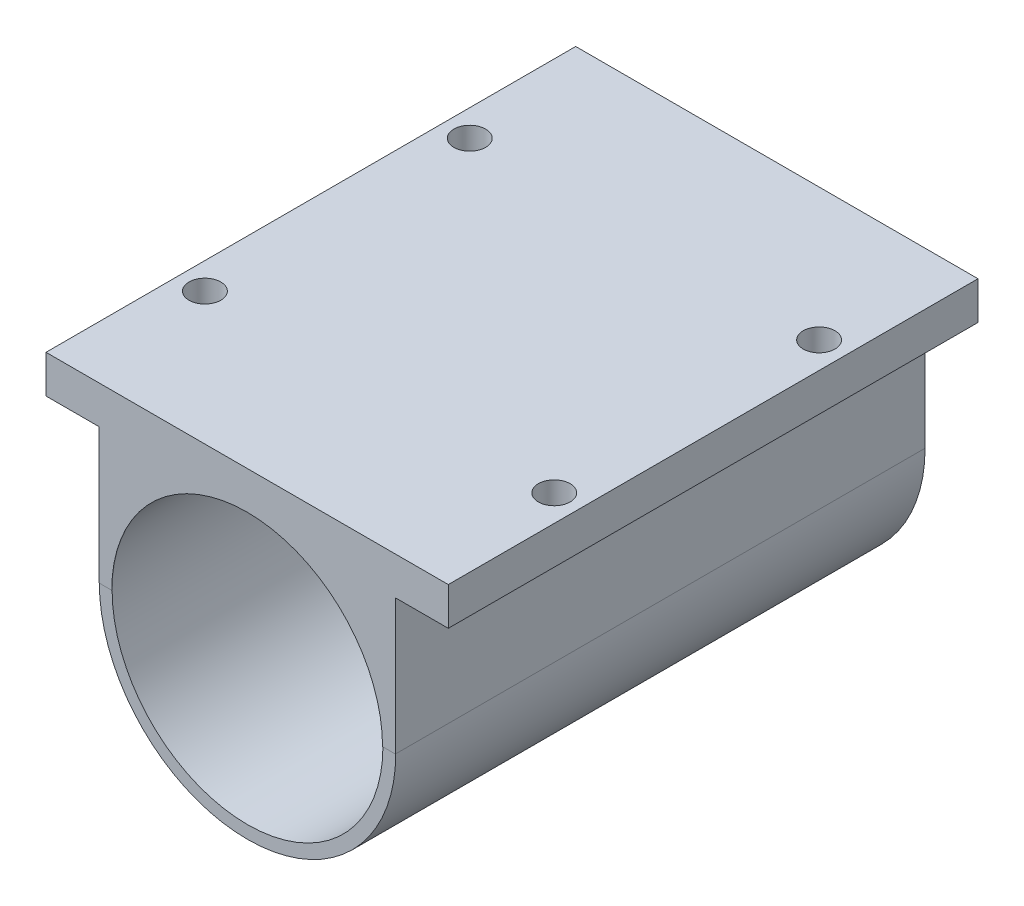
ISO-10303-21;
HEADER;
FILE_DESCRIPTION(('STEP AP214'),'2;1');
FILE_NAME('part.step','',(''),(''),'','','');
FILE_SCHEMA(('AUTOMOTIVE_DESIGN { 1 0 10303 214 1 1 1 1 }'));
ENDSEC;
DATA;
#1=APPLICATION_CONTEXT('core data for automotive mechanical design processes');
#2=APPLICATION_PROTOCOL_DEFINITION('international standard','automotive_design',2000,#1);
#3=PRODUCT_CONTEXT('',#1,'mechanical');
#4=PRODUCT('Part','Part','',(#3));
#5=PRODUCT_RELATED_PRODUCT_CATEGORY('part','',(#4));
#6=PRODUCT_DEFINITION_FORMATION('','',#4);
#7=PRODUCT_DEFINITION_CONTEXT('part definition',#1,'design');
#8=PRODUCT_DEFINITION('design','',#6,#7);
#9=PRODUCT_DEFINITION_SHAPE('','',#8);
#10=(LENGTH_UNIT() NAMED_UNIT(*) SI_UNIT(.MILLI.,.METRE.));
#11=(NAMED_UNIT(*) PLANE_ANGLE_UNIT() SI_UNIT($,.RADIAN.));
#12=(NAMED_UNIT(*) SI_UNIT($,.STERADIAN.) SOLID_ANGLE_UNIT());
#13=UNCERTAINTY_MEASURE_WITH_UNIT(LENGTH_MEASURE(1.E-05),#10,'distance_accuracy_value','');
#14=(GEOMETRIC_REPRESENTATION_CONTEXT(3) GLOBAL_UNCERTAINTY_ASSIGNED_CONTEXT((#13)) GLOBAL_UNIT_ASSIGNED_CONTEXT((#10,
#11,#12)) REPRESENTATION_CONTEXT('',''));
#15=CARTESIAN_POINT('',(0.,0.,0.));
#16=DIRECTION('',(0.,0.,1.));
#17=DIRECTION('',(1.,0.,0.));
#18=AXIS2_PLACEMENT_3D('',#15,#16,#17);
#19=CARTESIAN_POINT('',(-14.,21.,0.));
#20=DIRECTION('',(1.,0.,0.));
#21=DIRECTION('',(0.,0.,-1.));
#22=AXIS2_PLACEMENT_3D('',#19,#20,#21);
#23=PLANE('',#22);
#24=DIRECTION('',(0.,0.,1.));
#25=VECTOR('',#24,1.);
#26=CARTESIAN_POINT('',(-14.,12.7853008732396,0.));
#27=LINE('',#26,#25);
#28=CARTESIAN_POINT('',(-14.,12.7853008732396,0.));
#29=VERTEX_POINT('',#28);
#30=CARTESIAN_POINT('',(-14.,12.7853008732396,50.0348809107223));
#31=VERTEX_POINT('',#30);
#32=EDGE_CURVE('E143',#29,#31,#27,.T.);
#33=ORIENTED_EDGE('',*,*,#32,.F.);
#34=DIRECTION('',(0.,-1.,0.));
#35=VECTOR('',#34,1.);
#36=CARTESIAN_POINT('',(-14.,21.,0.));
#37=LINE('',#36,#35);
#38=CARTESIAN_POINT('',(-14.,0.,0.));
#39=VERTEX_POINT('',#38);
#40=EDGE_CURVE('E148',#29,#39,#37,.T.);
#41=ORIENTED_EDGE('',*,*,#40,.T.);
#42=DIRECTION('',(0.,0.,1.));
#43=VECTOR('',#42,1.);
#44=CARTESIAN_POINT('',(-14.,0.,0.));
#45=LINE('',#44,#43);
#46=CARTESIAN_POINT('',(-14.,0.,50.));
#47=VERTEX_POINT('',#46);
#48=EDGE_CURVE('E209',#39,#47,#45,.T.);
#49=ORIENTED_EDGE('',*,*,#48,.T.);
#50=CARTESIAN_POINT('',(-14.,0.,50.0348809107223));
#51=VERTEX_POINT('',#50);
#52=EDGE_CURVE('E204',#47,#51,#45,.T.);
#53=ORIENTED_EDGE('',*,*,#52,.T.);
#54=DIRECTION('',(0.,-1.,0.));
#55=VECTOR('',#54,1.);
#56=CARTESIAN_POINT('',(-14.,21.,50.0348809107223));
#57=LINE('',#56,#55);
#58=EDGE_CURVE('E224',#31,#51,#57,.T.);
#59=ORIENTED_EDGE('',*,*,#58,.F.);
#60=EDGE_LOOP('',(#33,#41,#49,#53,#59));
#61=FACE_BOUND('',#60,.T.);
#62=ADVANCED_FACE('F37',(#61),#23,.F.);
#63=CARTESIAN_POINT('',(14.,21.,0.));
#64=DIRECTION('',(-1.,0.,0.));
#65=DIRECTION('',(0.,0.,1.));
#66=AXIS2_PLACEMENT_3D('',#63,#64,#65);
#67=PLANE('',#66);
#68=DIRECTION('',(0.,0.,-1.));
#69=VECTOR('',#68,1.);
#70=CARTESIAN_POINT('',(14.,12.7853008732396,50.0348809107223));
#71=LINE('',#70,#69);
#72=CARTESIAN_POINT('',(14.,12.7853008732396,50.0348809107223));
#73=VERTEX_POINT('',#72);
#74=CARTESIAN_POINT('',(14.,12.7853008732396,0.));
#75=VERTEX_POINT('',#74);
#76=EDGE_CURVE('E52',#73,#75,#71,.T.);
#77=ORIENTED_EDGE('',*,*,#76,.F.);
#78=DIRECTION('',(0.,-1.,0.));
#79=VECTOR('',#78,1.);
#80=CARTESIAN_POINT('',(14.,21.,50.0348809107223));
#81=LINE('',#80,#79);
#82=CARTESIAN_POINT('',(14.,0.,50.0348809107223));
#83=VERTEX_POINT('',#82);
#84=EDGE_CURVE('E222',#73,#83,#81,.T.);
#85=ORIENTED_EDGE('',*,*,#84,.T.);
#86=DIRECTION('',(0.,0.,-1.));
#87=VECTOR('',#86,1.);
#88=CARTESIAN_POINT('',(14.,0.,0.));
#89=LINE('',#88,#87);
#90=CARTESIAN_POINT('',(14.,0.,50.));
#91=VERTEX_POINT('',#90);
#92=EDGE_CURVE('E217',#83,#91,#89,.T.);
#93=ORIENTED_EDGE('',*,*,#92,.T.);
#94=CARTESIAN_POINT('',(14.,0.,0.));
#95=VERTEX_POINT('',#94);
#96=EDGE_CURVE('E216',#91,#95,#89,.T.);
#97=ORIENTED_EDGE('',*,*,#96,.T.);
#98=DIRECTION('',(0.,-1.,0.));
#99=VECTOR('',#98,1.);
#100=CARTESIAN_POINT('',(14.,21.,0.));
#101=LINE('',#100,#99);
#102=EDGE_CURVE('E57',#75,#95,#101,.T.);
#103=ORIENTED_EDGE('',*,*,#102,.F.);
#104=EDGE_LOOP('',(#77,#85,#93,#97,#103));
#105=FACE_BOUND('',#104,.T.);
#106=ADVANCED_FACE('F290',(#105),#67,.F.);
#107=CARTESIAN_POINT('',(0.,0.,0.));
#108=DIRECTION('',(0.,1.,0.));
#109=DIRECTION('',(0.,0.,1.));
#110=AXIS2_PLACEMENT_3D('',#107,#108,#109);
#111=PLANE('',#110);
#112=DIRECTION('',(-1.,0.,0.));
#113=VECTOR('',#112,1.);
#114=CARTESIAN_POINT('',(0.,0.,50.));
#115=LINE('',#114,#113);
#116=CARTESIAN_POINT('',(-12.79,0.,50.));
#117=VERTEX_POINT('',#116);
#118=CARTESIAN_POINT('',(-12.7918119668143,0.,50.));
#119=VERTEX_POINT('',#118);
#120=EDGE_CURVE('E232',#117,#119,#115,.T.);
#121=ORIENTED_EDGE('',*,*,#120,.F.);
#122=DIRECTION('',(0.,0.,1.));
#123=VECTOR('',#122,1.);
#124=CARTESIAN_POINT('',(-12.79,0.,29.0348809107223));
#125=LINE('',#124,#123);
#126=CARTESIAN_POINT('',(-12.79,0.,50.0348809107223));
#127=VERTEX_POINT('',#126);
#128=EDGE_CURVE('E192',#117,#127,#125,.T.);
#129=ORIENTED_EDGE('',*,*,#128,.T.);
#130=DIRECTION('',(1.,0.,0.));
#131=VECTOR('',#130,1.);
#132=CARTESIAN_POINT('',(-14.,0.,50.0348809107223));
#133=LINE('',#132,#131);
#134=EDGE_CURVE('E213',#51,#127,#133,.T.);
#135=ORIENTED_EDGE('',*,*,#134,.F.);
#136=ORIENTED_EDGE('',*,*,#52,.F.);
#137=EDGE_CURVE('E226',#119,#47,#115,.T.);
#138=ORIENTED_EDGE('',*,*,#137,.F.);
#139=EDGE_LOOP('',(#121,#129,#135,#136,#138));
#140=FACE_BOUND('',#139,.T.);
#141=ADVANCED_FACE('F296',(#140),#111,.F.);
#142=CARTESIAN_POINT('',(0.,0.,50.));
#143=DIRECTION('',(0.,0.,-1.));
#144=DIRECTION('',(-1.,0.,0.));
#145=AXIS2_PLACEMENT_3D('',#142,#143,#144);
#146=CYLINDRICAL_SURFACE('',#145,14.);
#147=ORIENTED_EDGE('',*,*,#96,.F.);
#148=CARTESIAN_POINT('',(0.,0.,50.));
#149=DIRECTION('',(0.,0.,1.));
#150=DIRECTION('',(1.,0.,0.));
#151=AXIS2_PLACEMENT_3D('',#148,#149,#150);
#152=CIRCLE('',#151,14.);
#153=EDGE_CURVE('E233',#47,#91,#152,.T.);
#154=ORIENTED_EDGE('',*,*,#153,.F.);
#155=ORIENTED_EDGE('',*,*,#48,.F.);
#156=CARTESIAN_POINT('',(0.,0.,0.));
#157=DIRECTION('',(0.,0.,1.));
#158=DIRECTION('',(1.,0.,0.));
#159=AXIS2_PLACEMENT_3D('',#156,#157,#158);
#160=CIRCLE('',#159,14.);
#161=EDGE_CURVE('E230',#39,#95,#160,.T.);
#162=ORIENTED_EDGE('',*,*,#161,.T.);
#163=EDGE_LOOP('',(#147,#154,#155,#162));
#164=FACE_BOUND('',#163,.T.);
#165=ADVANCED_FACE('F304',(#164),#146,.T.);
#166=CARTESIAN_POINT('',(0.,0.,50.));
#167=DIRECTION('',(0.,0.,1.));
#168=DIRECTION('',(1.,0.,0.));
#169=AXIS2_PLACEMENT_3D('',#166,#167,#168);
#170=PLANE('',#169);
#171=CARTESIAN_POINT('',(0.,0.,50.));
#172=DIRECTION('',(0.,0.,1.));
#173=DIRECTION('',(1.,0.,0.));
#174=AXIS2_PLACEMENT_3D('',#171,#172,#173);
#175=CIRCLE('',#174,12.7918119668143);
#176=CARTESIAN_POINT('',(12.7918119668143,0.,50.));
#177=VERTEX_POINT('',#176);
#178=EDGE_CURVE('E208',#119,#177,#175,.T.);
#179=ORIENTED_EDGE('',*,*,#178,.F.);
#180=ORIENTED_EDGE('',*,*,#137,.T.);
#181=ORIENTED_EDGE('',*,*,#153,.T.);
#182=EDGE_CURVE('E227',#91,#177,#115,.T.);
#183=ORIENTED_EDGE('',*,*,#182,.T.);
#184=EDGE_LOOP('',(#179,#180,#181,#183));
#185=FACE_BOUND('',#184,.T.);
#186=ADVANCED_FACE('F301',(#185),#170,.T.);
#187=CARTESIAN_POINT('',(0.,0.,0.));
#188=DIRECTION('',(0.,0.,1.));
#189=DIRECTION('',(1.,0.,0.));
#190=AXIS2_PLACEMENT_3D('',#187,#188,#189);
#191=PLANE('',#190);
#192=CARTESIAN_POINT('',(0.,8.5,0.));
#193=DIRECTION('',(0.,0.,1.));
#194=DIRECTION('',(1.,0.,0.));
#195=AXIS2_PLACEMENT_3D('',#192,#193,#194);
#196=CIRCLE('',#195,2.5);
#197=CARTESIAN_POINT('',(2.5,8.5,0.));
#198=VERTEX_POINT('',#197);
#199=EDGE_CURVE('E268',#198,#198,#196,.T.);
#200=ORIENTED_EDGE('',*,*,#199,.T.);
#201=EDGE_LOOP('',(#200));
#202=FACE_BOUND('',#201,.T.);
#203=CARTESIAN_POINT('',(-8.5,0.,0.));
#204=DIRECTION('',(0.,0.,1.));
#205=DIRECTION('',(1.,0.,0.));
#206=AXIS2_PLACEMENT_3D('',#203,#204,#205);
#207=CIRCLE('',#206,2.5);
#208=CARTESIAN_POINT('',(-6.,0.,0.));
#209=VERTEX_POINT('',#208);
#210=EDGE_CURVE('E265',#209,#209,#207,.T.);
#211=ORIENTED_EDGE('',*,*,#210,.T.);
#212=EDGE_LOOP('',(#211));
#213=FACE_BOUND('',#212,.T.);
#214=CARTESIAN_POINT('',(0.,-8.5,0.));
#215=DIRECTION('',(0.,0.,1.));
#216=DIRECTION('',(1.,0.,0.));
#217=AXIS2_PLACEMENT_3D('',#214,#215,#216);
#218=CIRCLE('',#217,2.5);
#219=CARTESIAN_POINT('',(2.5,-8.5,0.));
#220=VERTEX_POINT('',#219);
#221=EDGE_CURVE('E262',#220,#220,#218,.T.);
#222=ORIENTED_EDGE('',*,*,#221,.T.);
#223=EDGE_LOOP('',(#222));
#224=FACE_BOUND('',#223,.T.);
#225=CARTESIAN_POINT('',(8.5,0.,0.));
#226=DIRECTION('',(0.,0.,1.));
#227=DIRECTION('',(1.,0.,0.));
#228=AXIS2_PLACEMENT_3D('',#225,#226,#227);
#229=CIRCLE('',#228,2.49999999999999);
#230=CARTESIAN_POINT('',(11.,0.,0.));
#231=VERTEX_POINT('',#230);
#232=EDGE_CURVE('E256',#231,#231,#229,.T.);
#233=ORIENTED_EDGE('',*,*,#232,.T.);
#234=EDGE_LOOP('',(#233));
#235=FACE_BOUND('',#234,.T.);
#236=CARTESIAN_POINT('',(0.,0.,0.));
#237=DIRECTION('',(0.,0.,-1.));
#238=DIRECTION('',(-1.,0.,0.));
#239=AXIS2_PLACEMENT_3D('',#236,#237,#238);
#240=CIRCLE('',#239,4.);
#241=CARTESIAN_POINT('',(-4.,0.,0.));
#242=VERTEX_POINT('',#241);
#243=EDGE_CURVE('E196',#242,#242,#240,.T.);
#244=ORIENTED_EDGE('',*,*,#243,.F.);
#245=EDGE_LOOP('',(#244));
#246=FACE_BOUND('',#245,.T.);
#247=ORIENTED_EDGE('',*,*,#40,.F.);
#248=DIRECTION('',(1.,0.,0.));
#249=VECTOR('',#248,1.);
#250=CARTESIAN_POINT('',(-19.,12.7853008732396,0.));
#251=LINE('',#250,#249);
#252=CARTESIAN_POINT('',(-19.,12.7853008732396,0.));
#253=VERTEX_POINT('',#252);
#254=EDGE_CURVE('E127',#253,#29,#251,.T.);
#255=ORIENTED_EDGE('',*,*,#254,.F.);
#256=DIRECTION('',(0.,-1.,0.));
#257=VECTOR('',#256,1.);
#258=CARTESIAN_POINT('',(-19.,16.3653008732396,0.));
#259=LINE('',#258,#257);
#260=CARTESIAN_POINT('',(-19.,16.3653008732396,0.));
#261=VERTEX_POINT('',#260);
#262=EDGE_CURVE('E135',#261,#253,#259,.T.);
#263=ORIENTED_EDGE('',*,*,#262,.F.);
#264=DIRECTION('',(1.,0.,0.));
#265=VECTOR('',#264,1.);
#266=CARTESIAN_POINT('',(0.,16.3653008732396,0.));
#267=LINE('',#266,#265);
#268=CARTESIAN_POINT('',(19.,16.3653008732396,0.));
#269=VERTEX_POINT('',#268);
#270=EDGE_CURVE('E185',#261,#269,#267,.T.);
#271=ORIENTED_EDGE('',*,*,#270,.T.);
#272=DIRECTION('',(0.,1.,0.));
#273=VECTOR('',#272,1.);
#274=CARTESIAN_POINT('',(19.,16.3653008732396,0.));
#275=LINE('',#274,#273);
#276=CARTESIAN_POINT('',(19.,12.7853008732396,0.));
#277=VERTEX_POINT('',#276);
#278=EDGE_CURVE('E170',#277,#269,#275,.T.);
#279=ORIENTED_EDGE('',*,*,#278,.F.);
#280=DIRECTION('',(-1.,0.,0.));
#281=VECTOR('',#280,1.);
#282=CARTESIAN_POINT('',(19.,12.7853008732396,0.));
#283=LINE('',#282,#281);
#284=EDGE_CURVE('E176',#277,#75,#283,.T.);
#285=ORIENTED_EDGE('',*,*,#284,.T.);
#286=ORIENTED_EDGE('',*,*,#102,.T.);
#287=ORIENTED_EDGE('',*,*,#161,.F.);
#288=EDGE_LOOP('',(#247,#255,#263,#271,#279,#285,#286,#287));
#289=FACE_BOUND('',#288,.T.);
#290=ADVANCED_FACE('F146',(#202,#213,#224,#235,#246,#289),#191,.F.);
#291=CARTESIAN_POINT('',(-14.,21.,50.0348809107223));
#292=DIRECTION('',(0.,0.,-1.));
#293=DIRECTION('',(-1.,0.,0.));
#294=AXIS2_PLACEMENT_3D('',#291,#292,#293);
#295=PLANE('',#294);
#296=ORIENTED_EDGE('',*,*,#84,.F.);
#297=DIRECTION('',(-1.,0.,0.));
#298=VECTOR('',#297,1.);
#299=CARTESIAN_POINT('',(19.,12.7853008732396,50.0348809107223));
#300=LINE('',#299,#298);
#301=CARTESIAN_POINT('',(19.,12.7853008732396,50.0348809107223));
#302=VERTEX_POINT('',#301);
#303=EDGE_CURVE('E180',#302,#73,#300,.T.);
#304=ORIENTED_EDGE('',*,*,#303,.F.);
#305=DIRECTION('',(0.,-1.,0.));
#306=VECTOR('',#305,1.);
#307=CARTESIAN_POINT('',(19.,16.3653008732396,50.0348809107223));
#308=LINE('',#307,#306);
#309=CARTESIAN_POINT('',(19.,16.3653008732396,50.0348809107223));
#310=VERTEX_POINT('',#309);
#311=EDGE_CURVE('E165',#310,#302,#308,.T.);
#312=ORIENTED_EDGE('',*,*,#311,.F.);
#313=DIRECTION('',(1.,0.,0.));
#314=VECTOR('',#313,1.);
#315=CARTESIAN_POINT('',(-14.,16.3653008732396,50.0348809107223));
#316=LINE('',#315,#314);
#317=CARTESIAN_POINT('',(-19.,16.3653008732396,50.0348809107223));
#318=VERTEX_POINT('',#317);
#319=EDGE_CURVE('E183',#318,#310,#316,.T.);
#320=ORIENTED_EDGE('',*,*,#319,.F.);
#321=DIRECTION('',(0.,1.,0.));
#322=VECTOR('',#321,1.);
#323=CARTESIAN_POINT('',(-19.,16.3653008732396,50.0348809107223));
#324=LINE('',#323,#322);
#325=CARTESIAN_POINT('',(-19.,12.7853008732396,50.0348809107223));
#326=VERTEX_POINT('',#325);
#327=EDGE_CURVE('E134',#326,#318,#324,.T.);
#328=ORIENTED_EDGE('',*,*,#327,.F.);
#329=DIRECTION('',(1.,0.,0.));
#330=VECTOR('',#329,1.);
#331=CARTESIAN_POINT('',(-19.,12.7853008732396,50.0348809107223));
#332=LINE('',#331,#330);
#333=EDGE_CURVE('E130',#326,#31,#332,.T.);
#334=ORIENTED_EDGE('',*,*,#333,.T.);
#335=ORIENTED_EDGE('',*,*,#58,.T.);
#336=ORIENTED_EDGE('',*,*,#134,.T.);
#337=CARTESIAN_POINT('',(0.,0.,50.0348809107223));
#338=DIRECTION('',(0.,0.,1.));
#339=DIRECTION('',(1.,0.,0.));
#340=AXIS2_PLACEMENT_3D('',#337,#338,#339);
#341=CIRCLE('',#340,12.79);
#342=CARTESIAN_POINT('',(12.79,0.,50.0348809107223));
#343=VERTEX_POINT('',#342);
#344=EDGE_CURVE('E187',#343,#127,#341,.T.);
#345=ORIENTED_EDGE('',*,*,#344,.F.);
#346=EDGE_CURVE('E212',#343,#83,#133,.T.);
#347=ORIENTED_EDGE('',*,*,#346,.T.);
#348=EDGE_LOOP('',(#296,#304,#312,#320,#328,#334,#335,#336,#345,#347));
#349=FACE_BOUND('',#348,.T.);
#350=ADVANCED_FACE('F300',(#349),#295,.F.);
#351=ORIENTED_EDGE('',*,*,#346,.F.);
#352=DIRECTION('',(0.,0.,1.));
#353=VECTOR('',#352,1.);
#354=CARTESIAN_POINT('',(12.79,0.,29.0348809107223));
#355=LINE('',#354,#353);
#356=CARTESIAN_POINT('',(12.79,0.,50.));
#357=VERTEX_POINT('',#356);
#358=EDGE_CURVE('E189',#343,#357,#355,.F.);
#359=ORIENTED_EDGE('',*,*,#358,.T.);
#360=EDGE_CURVE('E231',#177,#357,#115,.T.);
#361=ORIENTED_EDGE('',*,*,#360,.F.);
#362=ORIENTED_EDGE('',*,*,#182,.F.);
#363=ORIENTED_EDGE('',*,*,#92,.F.);
#364=EDGE_LOOP('',(#351,#359,#361,#362,#363));
#365=FACE_BOUND('',#364,.T.);
#366=ADVANCED_FACE('F360',(#365),#111,.F.);
#367=CARTESIAN_POINT('',(0.,0.,50.));
#368=DIRECTION('',(0.,0.,1.));
#369=DIRECTION('',(1.,0.,0.));
#370=AXIS2_PLACEMENT_3D('',#367,#368,#369);
#371=PLANE('',#370);
#372=ORIENTED_EDGE('',*,*,#360,.T.);
#373=CARTESIAN_POINT('',(0.,0.,50.));
#374=DIRECTION('',(0.,0.,1.));
#375=DIRECTION('',(1.,0.,0.));
#376=AXIS2_PLACEMENT_3D('',#373,#374,#375);
#377=CIRCLE('',#376,12.79);
#378=EDGE_CURVE('E236',#357,#117,#377,.T.);
#379=ORIENTED_EDGE('',*,*,#378,.T.);
#380=ORIENTED_EDGE('',*,*,#120,.T.);
#381=EDGE_CURVE('E205',#177,#119,#175,.T.);
#382=ORIENTED_EDGE('',*,*,#381,.F.);
#383=EDGE_LOOP('',(#372,#379,#380,#382));
#384=FACE_BOUND('',#383,.T.);
#385=ADVANCED_FACE('F344',(#384),#371,.F.);
#386=CARTESIAN_POINT('',(0.,0.,2.00000000000002));
#387=DIRECTION('',(0.,0.,1.));
#388=DIRECTION('',(1.,0.,0.));
#389=AXIS2_PLACEMENT_3D('',#386,#387,#388);
#390=CYLINDRICAL_SURFACE('',#389,12.7918119668143);
#391=CARTESIAN_POINT('',(0.,0.,2.00000000000002));
#392=DIRECTION('',(0.,0.,1.));
#393=DIRECTION('',(1.,0.,0.));
#394=AXIS2_PLACEMENT_3D('',#391,#392,#393);
#395=CIRCLE('',#394,12.7918119668143);
#396=CARTESIAN_POINT('',(12.7918119668143,0.,2.00000000000002));
#397=VERTEX_POINT('',#396);
#398=EDGE_CURVE('E201',#397,#397,#395,.T.);
#399=ORIENTED_EDGE('',*,*,#398,.F.);
#400=EDGE_LOOP('',(#399));
#401=FACE_BOUND('',#400,.T.);
#402=ORIENTED_EDGE('',*,*,#381,.T.);
#403=ORIENTED_EDGE('',*,*,#178,.T.);
#404=EDGE_LOOP('',(#402,#403));
#405=FACE_BOUND('',#404,.T.);
#406=ADVANCED_FACE('F335',(#401,#405),#390,.F.);
#407=CARTESIAN_POINT('',(0.,0.,2.00000000000002));
#408=DIRECTION('',(0.,0.,1.));
#409=DIRECTION('',(1.,0.,0.));
#410=AXIS2_PLACEMENT_3D('',#407,#408,#409);
#411=PLANE('',#410);
#412=CARTESIAN_POINT('',(0.,-8.5,2.00000000000002));
#413=DIRECTION('',(0.,0.,1.));
#414=DIRECTION('',(1.,0.,0.));
#415=AXIS2_PLACEMENT_3D('',#412,#413,#414);
#416=CIRCLE('',#415,1.5);
#417=CARTESIAN_POINT('',(1.5,-8.5,2.00000000000002));
#418=VERTEX_POINT('',#417);
#419=EDGE_CURVE('E200',#418,#418,#416,.T.);
#420=ORIENTED_EDGE('',*,*,#419,.F.);
#421=EDGE_LOOP('',(#420));
#422=FACE_BOUND('',#421,.T.);
#423=CARTESIAN_POINT('',(0.,8.5,2.00000000000002));
#424=DIRECTION('',(0.,0.,1.));
#425=DIRECTION('',(1.,0.,0.));
#426=AXIS2_PLACEMENT_3D('',#423,#424,#425);
#427=CIRCLE('',#426,1.5);
#428=CARTESIAN_POINT('',(1.5,8.5,2.00000000000002));
#429=VERTEX_POINT('',#428);
#430=EDGE_CURVE('E246',#429,#429,#427,.T.);
#431=ORIENTED_EDGE('',*,*,#430,.F.);
#432=EDGE_LOOP('',(#431));
#433=FACE_BOUND('',#432,.T.);
#434=CARTESIAN_POINT('',(-8.5,0.,2.00000000000002));
#435=DIRECTION('',(0.,0.,1.));
#436=DIRECTION('',(1.,0.,0.));
#437=AXIS2_PLACEMENT_3D('',#434,#435,#436);
#438=CIRCLE('',#437,1.5);
#439=CARTESIAN_POINT('',(-7.,0.,2.00000000000002));
#440=VERTEX_POINT('',#439);
#441=EDGE_CURVE('E243',#440,#440,#438,.T.);
#442=ORIENTED_EDGE('',*,*,#441,.F.);
#443=EDGE_LOOP('',(#442));
#444=FACE_BOUND('',#443,.T.);
#445=CARTESIAN_POINT('',(8.5,0.,2.00000000000002));
#446=DIRECTION('',(0.,0.,1.));
#447=DIRECTION('',(1.,0.,0.));
#448=AXIS2_PLACEMENT_3D('',#445,#446,#447);
#449=CIRCLE('',#448,1.49999999999999);
#450=CARTESIAN_POINT('',(9.99999999999999,0.,2.00000000000002));
#451=VERTEX_POINT('',#450);
#452=EDGE_CURVE('E195',#451,#451,#449,.T.);
#453=ORIENTED_EDGE('',*,*,#452,.F.);
#454=EDGE_LOOP('',(#453));
#455=FACE_BOUND('',#454,.T.);
#456=CARTESIAN_POINT('',(0.,0.,2.00000000000002));
#457=DIRECTION('',(0.,0.,1.));
#458=DIRECTION('',(1.,0.,0.));
#459=AXIS2_PLACEMENT_3D('',#456,#457,#458);
#460=CIRCLE('',#459,4.);
#461=CARTESIAN_POINT('',(4.,0.,2.00000000000002));
#462=VERTEX_POINT('',#461);
#463=EDGE_CURVE('E199',#462,#462,#460,.T.);
#464=ORIENTED_EDGE('',*,*,#463,.F.);
#465=EDGE_LOOP('',(#464));
#466=FACE_BOUND('',#465,.T.);
#467=ORIENTED_EDGE('',*,*,#398,.T.);
#468=EDGE_LOOP('',(#467));
#469=FACE_BOUND('',#468,.T.);
#470=ADVANCED_FACE('F332',(#422,#433,#444,#455,#466,#469),#411,.T.);
#471=CARTESIAN_POINT('',(0.,0.,49.));
#472=DIRECTION('',(0.,0.,-1.));
#473=DIRECTION('',(-1.,0.,0.));
#474=AXIS2_PLACEMENT_3D('',#471,#472,#473);
#475=CYLINDRICAL_SURFACE('',#474,4.);
#476=ORIENTED_EDGE('',*,*,#463,.T.);
#477=EDGE_LOOP('',(#476));
#478=FACE_BOUND('',#477,.T.);
#479=ORIENTED_EDGE('',*,*,#243,.T.);
#480=EDGE_LOOP('',(#479));
#481=FACE_BOUND('',#480,.T.);
#482=ADVANCED_FACE('F328',(#478,#481),#475,.F.);
#483=CARTESIAN_POINT('',(8.5,0.,49.));
#484=DIRECTION('',(0.,0.,-1.));
#485=DIRECTION('',(-1.,0.,0.));
#486=AXIS2_PLACEMENT_3D('',#483,#484,#485);
#487=CYLINDRICAL_SURFACE('',#486,1.49999999999999);
#488=CARTESIAN_POINT('',(8.5,0.,1.00000000000001));
#489=DIRECTION('',(0.,0.,1.));
#490=DIRECTION('',(1.,0.,0.));
#491=AXIS2_PLACEMENT_3D('',#488,#489,#490);
#492=CIRCLE('',#491,1.49999999999999);
#493=CARTESIAN_POINT('',(9.99999999999999,0.,1.00000000000001));
#494=VERTEX_POINT('',#493);
#495=EDGE_CURVE('E253',#494,#494,#492,.F.);
#496=ORIENTED_EDGE('',*,*,#495,.T.);
#497=EDGE_LOOP('',(#496));
#498=FACE_BOUND('',#497,.T.);
#499=ORIENTED_EDGE('',*,*,#452,.T.);
#500=EDGE_LOOP('',(#499));
#501=FACE_BOUND('',#500,.T.);
#502=ADVANCED_FACE('F325',(#498,#501),#487,.F.);
#503=CARTESIAN_POINT('',(-8.5,0.,49.));
#504=DIRECTION('',(0.,0.,-1.));
#505=DIRECTION('',(-1.,0.,0.));
#506=AXIS2_PLACEMENT_3D('',#503,#504,#505);
#507=CYLINDRICAL_SURFACE('',#506,1.5);
#508=CARTESIAN_POINT('',(-8.5,0.,1.00000000000001));
#509=DIRECTION('',(0.,0.,1.));
#510=DIRECTION('',(1.,0.,0.));
#511=AXIS2_PLACEMENT_3D('',#508,#509,#510);
#512=CIRCLE('',#511,1.5);
#513=CARTESIAN_POINT('',(-7.,0.,1.00000000000001));
#514=VERTEX_POINT('',#513);
#515=EDGE_CURVE('E45',#514,#514,#512,.F.);
#516=ORIENTED_EDGE('',*,*,#515,.T.);
#517=EDGE_LOOP('',(#516));
#518=FACE_BOUND('',#517,.T.);
#519=ORIENTED_EDGE('',*,*,#441,.T.);
#520=EDGE_LOOP('',(#519));
#521=FACE_BOUND('',#520,.T.);
#522=ADVANCED_FACE('F273',(#518,#521),#507,.F.);
#523=CARTESIAN_POINT('',(0.,8.5,49.));
#524=DIRECTION('',(0.,0.,-1.));
#525=DIRECTION('',(-1.,0.,0.));
#526=AXIS2_PLACEMENT_3D('',#523,#524,#525);
#527=CYLINDRICAL_SURFACE('',#526,1.5);
#528=CARTESIAN_POINT('',(0.,8.5,1.00000000000001));
#529=DIRECTION('',(0.,0.,1.));
#530=DIRECTION('',(1.,0.,0.));
#531=AXIS2_PLACEMENT_3D('',#528,#529,#530);
#532=CIRCLE('',#531,1.5);
#533=CARTESIAN_POINT('',(1.5,8.5,1.00000000000001));
#534=VERTEX_POINT('',#533);
#535=EDGE_CURVE('E259',#534,#534,#532,.F.);
#536=ORIENTED_EDGE('',*,*,#535,.T.);
#537=EDGE_LOOP('',(#536));
#538=FACE_BOUND('',#537,.T.);
#539=ORIENTED_EDGE('',*,*,#430,.T.);
#540=EDGE_LOOP('',(#539));
#541=FACE_BOUND('',#540,.T.);
#542=ADVANCED_FACE('F438',(#538,#541),#527,.F.);
#543=CARTESIAN_POINT('',(0.,-8.5,49.));
#544=DIRECTION('',(0.,0.,-1.));
#545=DIRECTION('',(-1.,0.,0.));
#546=AXIS2_PLACEMENT_3D('',#543,#544,#545);
#547=CYLINDRICAL_SURFACE('',#546,1.5);
#548=CARTESIAN_POINT('',(0.,-8.5,1.00000000000001));
#549=DIRECTION('',(0.,0.,1.));
#550=DIRECTION('',(1.,0.,0.));
#551=AXIS2_PLACEMENT_3D('',#548,#549,#550);
#552=CIRCLE('',#551,1.5);
#553=CARTESIAN_POINT('',(1.5,-8.5,1.00000000000001));
#554=VERTEX_POINT('',#553);
#555=EDGE_CURVE('E11',#554,#554,#552,.F.);
#556=ORIENTED_EDGE('',*,*,#555,.T.);
#557=EDGE_LOOP('',(#556));
#558=FACE_BOUND('',#557,.T.);
#559=ORIENTED_EDGE('',*,*,#419,.T.);
#560=EDGE_LOOP('',(#559));
#561=FACE_BOUND('',#560,.T.);
#562=ADVANCED_FACE('F435',(#558,#561),#547,.F.);
#563=CARTESIAN_POINT('',(0.,0.,29.0348809107223));
#564=DIRECTION('',(0.,0.,1.));
#565=DIRECTION('',(1.,0.,0.));
#566=AXIS2_PLACEMENT_3D('',#563,#564,#565);
#567=CYLINDRICAL_SURFACE('',#566,12.79);
#568=ORIENTED_EDGE('',*,*,#378,.F.);
#569=ORIENTED_EDGE('',*,*,#358,.F.);
#570=ORIENTED_EDGE('',*,*,#344,.T.);
#571=ORIENTED_EDGE('',*,*,#128,.F.);
#572=EDGE_LOOP('',(#568,#569,#570,#571));
#573=FACE_BOUND('',#572,.T.);
#574=ADVANCED_FACE('F365',(#573),#567,.F.);
#575=CARTESIAN_POINT('',(-14.,16.3653008732396,-2.96511908927772));
#576=DIRECTION('',(0.,-1.,0.));
#577=DIRECTION('',(0.,0.,-1.));
#578=AXIS2_PLACEMENT_3D('',#575,#576,#577);
#579=PLANE('',#578);
#580=CARTESIAN_POINT('',(-16.5,16.3653008732396,12.5087202276806));
#581=DIRECTION('',(0.,-1.,0.));
#582=DIRECTION('',(0.,0.,-1.));
#583=AXIS2_PLACEMENT_3D('',#580,#581,#582);
#584=CIRCLE('',#583,1.5);
#585=CARTESIAN_POINT('',(-16.5,16.3653008732396,11.0087202276806));
#586=VERTEX_POINT('',#585);
#587=EDGE_CURVE('E383',#586,#586,#584,.T.);
#588=ORIENTED_EDGE('',*,*,#587,.T.);
#589=EDGE_LOOP('',(#588));
#590=FACE_BOUND('',#589,.T.);
#591=CARTESIAN_POINT('',(-16.5,16.3653008732396,37.5261606830417));
#592=DIRECTION('',(0.,-1.,0.));
#593=DIRECTION('',(0.,0.,-1.));
#594=AXIS2_PLACEMENT_3D('',#591,#592,#593);
#595=CIRCLE('',#594,1.5);
#596=CARTESIAN_POINT('',(-16.5,16.3653008732396,36.0261606830417));
#597=VERTEX_POINT('',#596);
#598=EDGE_CURVE('E385',#597,#597,#595,.T.);
#599=ORIENTED_EDGE('',*,*,#598,.T.);
#600=EDGE_LOOP('',(#599));
#601=FACE_BOUND('',#600,.T.);
#602=CARTESIAN_POINT('',(16.5,16.3653008732396,37.5261606830417));
#603=DIRECTION('',(0.,-1.,0.));
#604=DIRECTION('',(0.,0.,-1.));
#605=AXIS2_PLACEMENT_3D('',#602,#603,#604);
#606=CIRCLE('',#605,1.5);
#607=CARTESIAN_POINT('',(16.5,16.3653008732396,36.0261606830417));
#608=VERTEX_POINT('',#607);
#609=EDGE_CURVE('E162',#608,#608,#606,.T.);
#610=ORIENTED_EDGE('',*,*,#609,.T.);
#611=EDGE_LOOP('',(#610));
#612=FACE_BOUND('',#611,.T.);
#613=CARTESIAN_POINT('',(16.4999999999999,16.3653008732396,12.5087202276806));
#614=DIRECTION('',(0.,-1.,0.));
#615=DIRECTION('',(0.,0.,-1.));
#616=AXIS2_PLACEMENT_3D('',#613,#614,#615);
#617=CIRCLE('',#616,1.5);
#618=CARTESIAN_POINT('',(16.4999999999999,16.3653008732396,11.0087202276806));
#619=VERTEX_POINT('',#618);
#620=EDGE_CURVE('E158',#619,#619,#617,.T.);
#621=ORIENTED_EDGE('',*,*,#620,.T.);
#622=EDGE_LOOP('',(#621));
#623=FACE_BOUND('',#622,.T.);
#624=ORIENTED_EDGE('',*,*,#270,.F.);
#625=DIRECTION('',(0.,0.,-1.));
#626=VECTOR('',#625,1.);
#627=CARTESIAN_POINT('',(-19.,16.3653008732396,0.));
#628=LINE('',#627,#626);
#629=EDGE_CURVE('E141',#318,#261,#628,.T.);
#630=ORIENTED_EDGE('',*,*,#629,.F.);
#631=ORIENTED_EDGE('',*,*,#319,.T.);
#632=DIRECTION('',(0.,0.,1.));
#633=VECTOR('',#632,1.);
#634=CARTESIAN_POINT('',(19.,16.3653008732396,50.0348809107223));
#635=LINE('',#634,#633);
#636=EDGE_CURVE('E173',#269,#310,#635,.T.);
#637=ORIENTED_EDGE('',*,*,#636,.F.);
#638=EDGE_LOOP('',(#624,#630,#631,#637));
#639=FACE_BOUND('',#638,.T.);
#640=ADVANCED_FACE('F381',(#590,#601,#612,#623,#639),#579,.F.);
#641=CARTESIAN_POINT('',(19.,12.7853008732396,50.0348809107223));
#642=DIRECTION('',(0.,1.,0.));
#643=DIRECTION('',(0.,0.,1.));
#644=AXIS2_PLACEMENT_3D('',#641,#642,#643);
#645=PLANE('',#644);
#646=CARTESIAN_POINT('',(16.5,12.7853008732396,37.5261606830417));
#647=DIRECTION('',(0.,-1.,0.));
#648=DIRECTION('',(0.,0.,-1.));
#649=AXIS2_PLACEMENT_3D('',#646,#647,#648);
#650=CIRCLE('',#649,1.5);
#651=CARTESIAN_POINT('',(16.5,12.7853008732396,36.0261606830417));
#652=VERTEX_POINT('',#651);
#653=EDGE_CURVE('E152',#652,#652,#650,.T.);
#654=ORIENTED_EDGE('',*,*,#653,.F.);
#655=EDGE_LOOP('',(#654));
#656=FACE_BOUND('',#655,.T.);
#657=CARTESIAN_POINT('',(16.4999999999999,12.7853008732396,12.5087202276806));
#658=DIRECTION('',(0.,-1.,0.));
#659=DIRECTION('',(0.,0.,1.));
#660=AXIS2_PLACEMENT_3D('',#657,#658,#659);
#661=CIRCLE('',#660,1.5);
#662=CARTESIAN_POINT('',(16.4999999999999,12.7853008732396,14.0087202276806));
#663=VERTEX_POINT('',#662);
#664=EDGE_CURVE('E149',#663,#663,#661,.T.);
#665=ORIENTED_EDGE('',*,*,#664,.F.);
#666=EDGE_LOOP('',(#665));
#667=FACE_BOUND('',#666,.T.);
#668=ORIENTED_EDGE('',*,*,#76,.T.);
#669=ORIENTED_EDGE('',*,*,#284,.F.);
#670=DIRECTION('',(0.,0.,-1.));
#671=VECTOR('',#670,1.);
#672=CARTESIAN_POINT('',(19.,12.7853008732396,50.0348809107223));
#673=LINE('',#672,#671);
#674=EDGE_CURVE('E168',#302,#277,#673,.T.);
#675=ORIENTED_EDGE('',*,*,#674,.F.);
#676=ORIENTED_EDGE('',*,*,#303,.T.);
#677=EDGE_LOOP('',(#668,#669,#675,#676));
#678=FACE_BOUND('',#677,.T.);
#679=ADVANCED_FACE('F375',(#656,#667,#678),#645,.F.);
#680=CARTESIAN_POINT('',(19.,0.,0.));
#681=DIRECTION('',(1.,0.,0.));
#682=DIRECTION('',(0.,0.,-1.));
#683=AXIS2_PLACEMENT_3D('',#680,#681,#682);
#684=PLANE('',#683);
#685=ORIENTED_EDGE('',*,*,#311,.T.);
#686=ORIENTED_EDGE('',*,*,#674,.T.);
#687=ORIENTED_EDGE('',*,*,#278,.T.);
#688=ORIENTED_EDGE('',*,*,#636,.T.);
#689=EDGE_LOOP('',(#685,#686,#687,#688));
#690=FACE_BOUND('',#689,.T.);
#691=ADVANCED_FACE('F377',(#690),#684,.T.);
#692=CARTESIAN_POINT('',(16.4999999999999,17.7853008732396,12.5087202276806));
#693=DIRECTION('',(0.,-1.,0.));
#694=DIRECTION('',(0.,0.,-1.));
#695=AXIS2_PLACEMENT_3D('',#692,#693,#694);
#696=CYLINDRICAL_SURFACE('',#695,1.5);
#697=ORIENTED_EDGE('',*,*,#664,.T.);
#698=EDGE_LOOP('',(#697));
#699=FACE_BOUND('',#698,.T.);
#700=ORIENTED_EDGE('',*,*,#620,.F.);
#701=EDGE_LOOP('',(#700));
#702=FACE_BOUND('',#701,.T.);
#703=ADVANCED_FACE('F418',(#699,#702),#696,.F.);
#704=CARTESIAN_POINT('',(16.5,17.7853008732396,37.5261606830417));
#705=DIRECTION('',(0.,-1.,0.));
#706=DIRECTION('',(0.,0.,-1.));
#707=AXIS2_PLACEMENT_3D('',#704,#705,#706);
#708=CYLINDRICAL_SURFACE('',#707,1.5);
#709=ORIENTED_EDGE('',*,*,#653,.T.);
#710=EDGE_LOOP('',(#709));
#711=FACE_BOUND('',#710,.T.);
#712=ORIENTED_EDGE('',*,*,#609,.F.);
#713=EDGE_LOOP('',(#712));
#714=FACE_BOUND('',#713,.T.);
#715=ADVANCED_FACE('F402',(#711,#714),#708,.F.);
#716=CARTESIAN_POINT('',(-19.,12.7853008732396,0.));
#717=DIRECTION('',(0.,1.,0.));
#718=DIRECTION('',(0.,0.,1.));
#719=AXIS2_PLACEMENT_3D('',#716,#717,#718);
#720=PLANE('',#719);
#721=CARTESIAN_POINT('',(-16.5,12.7853008732396,12.5087202276806));
#722=DIRECTION('',(0.,-1.,0.));
#723=DIRECTION('',(0.,0.,-1.));
#724=AXIS2_PLACEMENT_3D('',#721,#722,#723);
#725=CIRCLE('',#724,1.5);
#726=CARTESIAN_POINT('',(-16.5,12.7853008732396,11.0087202276806));
#727=VERTEX_POINT('',#726);
#728=EDGE_CURVE('E390',#727,#727,#725,.T.);
#729=ORIENTED_EDGE('',*,*,#728,.F.);
#730=EDGE_LOOP('',(#729));
#731=FACE_BOUND('',#730,.T.);
#732=CARTESIAN_POINT('',(-16.5,12.7853008732396,37.5261606830417));
#733=DIRECTION('',(0.,-1.,0.));
#734=DIRECTION('',(0.,0.,1.));
#735=AXIS2_PLACEMENT_3D('',#732,#733,#734);
#736=CIRCLE('',#735,1.5);
#737=CARTESIAN_POINT('',(-16.5,12.7853008732396,39.0261606830417));
#738=VERTEX_POINT('',#737);
#739=EDGE_CURVE('E393',#738,#738,#736,.T.);
#740=ORIENTED_EDGE('',*,*,#739,.F.);
#741=EDGE_LOOP('',(#740));
#742=FACE_BOUND('',#741,.T.);
#743=ORIENTED_EDGE('',*,*,#32,.T.);
#744=ORIENTED_EDGE('',*,*,#333,.F.);
#745=DIRECTION('',(0.,0.,1.));
#746=VECTOR('',#745,1.);
#747=CARTESIAN_POINT('',(-19.,12.7853008732396,0.));
#748=LINE('',#747,#746);
#749=EDGE_CURVE('E123',#253,#326,#748,.T.);
#750=ORIENTED_EDGE('',*,*,#749,.F.);
#751=ORIENTED_EDGE('',*,*,#254,.T.);
#752=EDGE_LOOP('',(#743,#744,#750,#751));
#753=FACE_BOUND('',#752,.T.);
#754=ADVANCED_FACE('F125',(#731,#742,#753),#720,.F.);
#755=CARTESIAN_POINT('',(-19.,0.,0.));
#756=DIRECTION('',(-1.,0.,0.));
#757=DIRECTION('',(0.,0.,1.));
#758=AXIS2_PLACEMENT_3D('',#755,#756,#757);
#759=PLANE('',#758);
#760=ORIENTED_EDGE('',*,*,#262,.T.);
#761=ORIENTED_EDGE('',*,*,#749,.T.);
#762=ORIENTED_EDGE('',*,*,#327,.T.);
#763=ORIENTED_EDGE('',*,*,#629,.T.);
#764=EDGE_LOOP('',(#760,#761,#762,#763));
#765=FACE_BOUND('',#764,.T.);
#766=ADVANCED_FACE('F139',(#765),#759,.T.);
#767=CARTESIAN_POINT('',(-16.5,17.7853008732396,37.5261606830417));
#768=DIRECTION('',(0.,-1.,0.));
#769=DIRECTION('',(0.,0.,-1.));
#770=AXIS2_PLACEMENT_3D('',#767,#768,#769);
#771=CYLINDRICAL_SURFACE('',#770,1.5);
#772=ORIENTED_EDGE('',*,*,#739,.T.);
#773=EDGE_LOOP('',(#772));
#774=FACE_BOUND('',#773,.T.);
#775=ORIENTED_EDGE('',*,*,#598,.F.);
#776=EDGE_LOOP('',(#775));
#777=FACE_BOUND('',#776,.T.);
#778=ADVANCED_FACE('F318',(#774,#777),#771,.F.);
#779=CARTESIAN_POINT('',(-16.5,17.7853008732396,12.5087202276806));
#780=DIRECTION('',(0.,-1.,0.));
#781=DIRECTION('',(0.,0.,-1.));
#782=AXIS2_PLACEMENT_3D('',#779,#780,#781);
#783=CYLINDRICAL_SURFACE('',#782,1.5);
#784=ORIENTED_EDGE('',*,*,#728,.T.);
#785=EDGE_LOOP('',(#784));
#786=FACE_BOUND('',#785,.T.);
#787=ORIENTED_EDGE('',*,*,#587,.F.);
#788=EDGE_LOOP('',(#787));
#789=FACE_BOUND('',#788,.T.);
#790=ADVANCED_FACE('F313',(#786,#789),#783,.F.);
#791=CARTESIAN_POINT('',(8.5,0.,1.));
#792=DIRECTION('',(0.,0.,1.));
#793=DIRECTION('',(1.,0.,0.));
#794=AXIS2_PLACEMENT_3D('',#791,#792,#793);
#795=TOROIDAL_SURFACE('',#794,2.49999999999999,1.);
#796=ORIENTED_EDGE('',*,*,#232,.F.);
#797=EDGE_LOOP('',(#796));
#798=FACE_BOUND('',#797,.T.);
#799=ORIENTED_EDGE('',*,*,#495,.F.);
#800=EDGE_LOOP('',(#799));
#801=FACE_BOUND('',#800,.T.);
#802=ADVANCED_FACE('F285',(#798,#801),#795,.T.);
#803=CARTESIAN_POINT('',(0.,8.5,1.));
#804=DIRECTION('',(0.,0.,1.));
#805=DIRECTION('',(1.,0.,0.));
#806=AXIS2_PLACEMENT_3D('',#803,#804,#805);
#807=TOROIDAL_SURFACE('',#806,2.5,1.);
#808=ORIENTED_EDGE('',*,*,#199,.F.);
#809=EDGE_LOOP('',(#808));
#810=FACE_BOUND('',#809,.T.);
#811=ORIENTED_EDGE('',*,*,#535,.F.);
#812=EDGE_LOOP('',(#811));
#813=FACE_BOUND('',#812,.T.);
#814=ADVANCED_FACE('F278',(#810,#813),#807,.T.);
#815=CARTESIAN_POINT('',(-8.5,0.,1.));
#816=DIRECTION('',(0.,0.,1.));
#817=DIRECTION('',(1.,0.,0.));
#818=AXIS2_PLACEMENT_3D('',#815,#816,#817);
#819=TOROIDAL_SURFACE('',#818,2.5,1.);
#820=ORIENTED_EDGE('',*,*,#210,.F.);
#821=EDGE_LOOP('',(#820));
#822=FACE_BOUND('',#821,.T.);
#823=ORIENTED_EDGE('',*,*,#515,.F.);
#824=EDGE_LOOP('',(#823));
#825=FACE_BOUND('',#824,.T.);
#826=ADVANCED_FACE('F276',(#822,#825),#819,.T.);
#827=CARTESIAN_POINT('',(0.,-8.5,1.));
#828=DIRECTION('',(0.,0.,1.));
#829=DIRECTION('',(1.,0.,0.));
#830=AXIS2_PLACEMENT_3D('',#827,#828,#829);
#831=TOROIDAL_SURFACE('',#830,2.5,1.);
#832=ORIENTED_EDGE('',*,*,#221,.F.);
#833=EDGE_LOOP('',(#832));
#834=FACE_BOUND('',#833,.T.);
#835=ORIENTED_EDGE('',*,*,#555,.F.);
#836=EDGE_LOOP('',(#835));
#837=FACE_BOUND('',#836,.T.);
#838=ADVANCED_FACE('F39',(#834,#837),#831,.T.);
#839=CLOSED_SHELL('',(#62,#106,#141,#165,#186,#290,#350,#366,#385,#406,#470,#482,#502,#522,#542,
#562,#574,#640,#679,#691,#703,#715,#754,#766,#778,#790,#802,#814,#826,#838));
#840=MANIFOLD_SOLID_BREP('B2',#839);
#841=ADVANCED_BREP_SHAPE_REPRESENTATION('',(#18,#840),#14);
#842=SHAPE_DEFINITION_REPRESENTATION(#9,#841);
ENDSEC;
END-ISO-10303-21;
